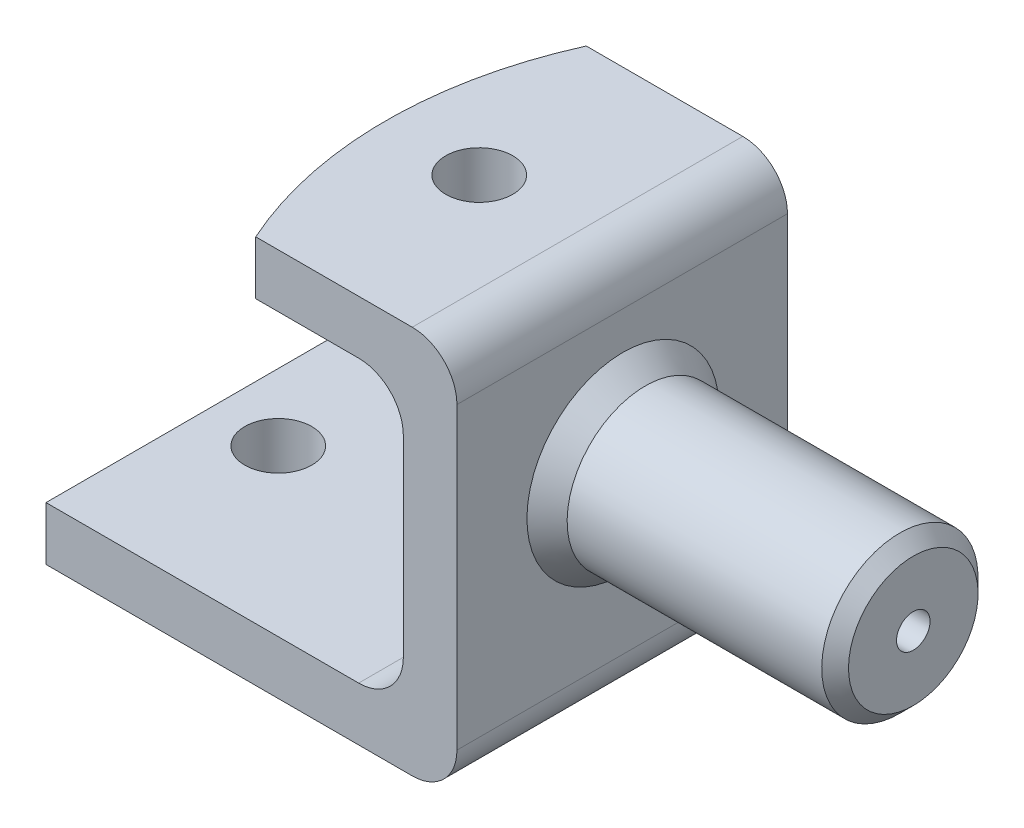
ISO-10303-21;
HEADER;
FILE_DESCRIPTION(('STEP AP214'),'2;1');
FILE_NAME('part.step','',(''),(''),'','','');
FILE_SCHEMA(('AUTOMOTIVE_DESIGN { 1 0 10303 214 1 1 1 1 }'));
ENDSEC;
DATA;
#1=APPLICATION_CONTEXT('core data for automotive mechanical design processes');
#2=APPLICATION_PROTOCOL_DEFINITION('international standard','automotive_design',2000,#1);
#3=PRODUCT_CONTEXT('',#1,'mechanical');
#4=PRODUCT('Part','Part','',(#3));
#5=PRODUCT_RELATED_PRODUCT_CATEGORY('part','',(#4));
#6=PRODUCT_DEFINITION_FORMATION('','',#4);
#7=PRODUCT_DEFINITION_CONTEXT('part definition',#1,'design');
#8=PRODUCT_DEFINITION('design','',#6,#7);
#9=PRODUCT_DEFINITION_SHAPE('','',#8);
#10=(LENGTH_UNIT() NAMED_UNIT(*) SI_UNIT(.MILLI.,.METRE.));
#11=(NAMED_UNIT(*) PLANE_ANGLE_UNIT() SI_UNIT($,.RADIAN.));
#12=(NAMED_UNIT(*) SI_UNIT($,.STERADIAN.) SOLID_ANGLE_UNIT());
#13=UNCERTAINTY_MEASURE_WITH_UNIT(LENGTH_MEASURE(1.E-05),#10,'distance_accuracy_value','');
#14=(GEOMETRIC_REPRESENTATION_CONTEXT(3) GLOBAL_UNCERTAINTY_ASSIGNED_CONTEXT((#13)) GLOBAL_UNIT_ASSIGNED_CONTEXT((#10,
#11,#12)) REPRESENTATION_CONTEXT('',''));
#15=CARTESIAN_POINT('',(0.,0.,0.));
#16=DIRECTION('',(0.,0.,1.));
#17=DIRECTION('',(1.,0.,0.));
#18=AXIS2_PLACEMENT_3D('',#15,#16,#17);
#19=CARTESIAN_POINT('',(68.6210379074638,91.8510314456974,27.3777811831614));
#20=DIRECTION('',(1.,0.,0.));
#21=DIRECTION('',(0.,0.,-1.));
#22=AXIS2_PLACEMENT_3D('',#19,#20,#21);
#23=PLANE('',#22);
#24=DIRECTION('',(0.,-1.,0.));
#25=VECTOR('',#24,1.);
#26=CARTESIAN_POINT('',(68.6210379074638,91.8510314456974,101.377781183161));
#27=LINE('',#26,#25);
#28=CARTESIAN_POINT('',(68.6210379074638,81.8510314456974,101.377781183161));
#29=VERTEX_POINT('',#28);
#30=CARTESIAN_POINT('',(68.6210379074638,38.8510314456974,101.377781183161));
#31=VERTEX_POINT('',#30);
#32=EDGE_CURVE('P0_E169',#29,#31,#27,.T.);
#33=ORIENTED_EDGE('',*,*,#32,.F.);
#34=DIRECTION('',(0.,0.,1.));
#35=VECTOR('',#34,1.);
#36=CARTESIAN_POINT('',(68.6210379074638,81.8510314456974,27.3777811831614));
#37=LINE('',#36,#35);
#38=CARTESIAN_POINT('',(68.6210379074638,81.8510314456974,27.3777811831614));
#39=VERTEX_POINT('',#38);
#40=EDGE_CURVE('P0_E196',#29,#39,#37,.F.);
#41=ORIENTED_EDGE('',*,*,#40,.T.);
#42=DIRECTION('',(0.,-1.,0.));
#43=VECTOR('',#42,1.);
#44=CARTESIAN_POINT('',(68.6210379074638,91.8510314456974,27.3777811831614));
#45=LINE('',#44,#43);
#46=CARTESIAN_POINT('',(68.6210379074638,38.8510314456974,27.3777811831614));
#47=VERTEX_POINT('',#46);
#48=EDGE_CURVE('P0_E168',#39,#47,#45,.T.);
#49=ORIENTED_EDGE('',*,*,#48,.T.);
#50=DIRECTION('',(0.,0.,-1.));
#51=VECTOR('',#50,1.);
#52=CARTESIAN_POINT('',(68.6210379074638,38.8510314456974,101.377781183161));
#53=LINE('',#52,#51);
#54=EDGE_CURVE('P0_E194',#47,#31,#53,.F.);
#55=ORIENTED_EDGE('',*,*,#54,.T.);
#56=EDGE_LOOP('',(#33,#41,#49,#55));
#57=FACE_BOUND('',#56,.T.);
#58=ADVANCED_FACE('P0_F37',(#57),#23,.F.);
#59=CARTESIAN_POINT('',(117.621037907464,16.8510314456974,64.3777811831614));
#60=DIRECTION('',(0.,1.,0.));
#61=DIRECTION('',(0.,0.,1.));
#62=AXIS2_PLACEMENT_3D('',#59,#60,#61);
#63=CYLINDRICAL_SURFACE('',#62,90.0000000000001);
#64=DIRECTION('',(0.,1.,0.));
#65=VECTOR('',#64,1.);
#66=CARTESIAN_POINT('',(35.578366083589,16.8510314456974,27.3777811831614));
#67=LINE('',#66,#65);
#68=CARTESIAN_POINT('',(35.578366083589,91.8510314456974,27.3777811831614));
#69=VERTEX_POINT('',#68);
#70=CARTESIAN_POINT('',(35.578366083589,103.851031445697,27.3777811831614));
#71=VERTEX_POINT('',#70);
#72=EDGE_CURVE('P0_E187',#69,#71,#67,.T.);
#73=ORIENTED_EDGE('',*,*,#72,.F.);
#74=CARTESIAN_POINT('',(117.621037907464,91.8510314456974,64.3777811831614));
#75=DIRECTION('',(0.,-1.,0.));
#76=DIRECTION('',(0.,0.,-1.));
#77=AXIS2_PLACEMENT_3D('',#74,#75,#76);
#78=CIRCLE('',#77,90.0000000000001);
#79=CARTESIAN_POINT('',(35.578366083589,91.8510314456974,101.377781183161));
#80=VERTEX_POINT('',#79);
#81=EDGE_CURVE('P0_E166',#80,#69,#78,.T.);
#82=ORIENTED_EDGE('',*,*,#81,.F.);
#83=DIRECTION('',(0.,1.,0.));
#84=VECTOR('',#83,1.);
#85=CARTESIAN_POINT('',(35.578366083589,16.8510314456974,101.377781183161));
#86=LINE('',#85,#84);
#87=CARTESIAN_POINT('',(35.578366083589,103.851031445697,101.377781183161));
#88=VERTEX_POINT('',#87);
#89=EDGE_CURVE('P0_E185',#80,#88,#86,.T.);
#90=ORIENTED_EDGE('',*,*,#89,.T.);
#91=CARTESIAN_POINT('',(117.621037907464,103.851031445697,64.3777811831614));
#92=DIRECTION('',(0.,1.,0.));
#93=DIRECTION('',(0.,0.,1.));
#94=AXIS2_PLACEMENT_3D('',#91,#92,#93);
#95=CIRCLE('',#94,90.0000000000001);
#96=EDGE_CURVE('P0_E178',#71,#88,#95,.T.);
#97=ORIENTED_EDGE('',*,*,#96,.F.);
#98=EDGE_LOOP('',(#73,#82,#90,#97));
#99=FACE_BOUND('',#98,.T.);
#100=ADVANCED_FACE('P0_F253',(#99),#63,.T.);
#101=CARTESIAN_POINT('',(80.6210379074638,16.8510314456974,101.377781183161));
#102=DIRECTION('',(1.,0.,0.));
#103=DIRECTION('',(0.,0.,-1.));
#104=AXIS2_PLACEMENT_3D('',#101,#102,#103);
#105=PLANE('',#104);
#106=DIRECTION('',(0.,1.,0.));
#107=VECTOR('',#106,1.);
#108=CARTESIAN_POINT('',(80.6210379074638,16.8510314456974,101.377781183161));
#109=LINE('',#108,#107);
#110=CARTESIAN_POINT('',(80.6210379074638,26.8510314456974,101.377781183161));
#111=VERTEX_POINT('',#110);
#112=CARTESIAN_POINT('',(80.6210379074638,93.8510314456974,101.377781183161));
#113=VERTEX_POINT('',#112);
#114=EDGE_CURVE('P0_E182',#111,#113,#109,.T.);
#115=ORIENTED_EDGE('',*,*,#114,.F.);
#116=DIRECTION('',(0.,0.,-1.));
#117=VECTOR('',#116,1.);
#118=CARTESIAN_POINT('',(80.6210379074638,26.8510314456974,27.3777811831614));
#119=LINE('',#118,#117);
#120=CARTESIAN_POINT('',(80.6210379074638,26.8510314456974,27.3777811831614));
#121=VERTEX_POINT('',#120);
#122=EDGE_CURVE('P0_E203',#111,#121,#119,.T.);
#123=ORIENTED_EDGE('',*,*,#122,.T.);
#124=DIRECTION('',(0.,1.,0.));
#125=VECTOR('',#124,1.);
#126=CARTESIAN_POINT('',(80.6210379074638,16.8510314456974,27.3777811831614));
#127=LINE('',#126,#125);
#128=CARTESIAN_POINT('',(80.6210379074638,93.8510314456974,27.3777811831614));
#129=VERTEX_POINT('',#128);
#130=EDGE_CURVE('P0_E132',#121,#129,#127,.T.);
#131=ORIENTED_EDGE('',*,*,#130,.T.);
#132=DIRECTION('',(0.,0.,-1.));
#133=VECTOR('',#132,1.);
#134=CARTESIAN_POINT('',(80.6210379074638,93.8510314456974,101.377781183161));
#135=LINE('',#134,#133);
#136=EDGE_CURVE('P0_E201',#129,#113,#135,.F.);
#137=ORIENTED_EDGE('',*,*,#136,.T.);
#138=EDGE_LOOP('',(#115,#123,#131,#137));
#139=FACE_BOUND('',#138,.T.);
#140=ADVANCED_FACE('P0_F241',(#139),#105,.T.);
#141=CARTESIAN_POINT('',(35.578366083589,16.8510314456974,101.377781183161));
#142=DIRECTION('',(0.,0.,1.));
#143=DIRECTION('',(1.,0.,0.));
#144=AXIS2_PLACEMENT_3D('',#141,#142,#143);
#145=PLANE('',#144);
#146=DIRECTION('',(1.,0.,0.));
#147=VECTOR('',#146,1.);
#148=CARTESIAN_POINT('',(35.578366083589,16.8510314456974,101.377781183161));
#149=LINE('',#148,#147);
#150=CARTESIAN_POINT('',(-11.3789620925362,16.8510314456974,101.377781183161));
#151=VERTEX_POINT('',#150);
#152=CARTESIAN_POINT('',(70.6210379074638,16.8510314456974,101.377781183161));
#153=VERTEX_POINT('',#152);
#154=EDGE_CURVE('P0_E126',#151,#153,#149,.T.);
#155=ORIENTED_EDGE('',*,*,#154,.T.);
#156=CARTESIAN_POINT('',(70.6210379074638,26.8510314456974,101.377781183161));
#157=DIRECTION('',(0.,0.,1.));
#158=DIRECTION('',(1.,0.,0.));
#159=AXIS2_PLACEMENT_3D('',#156,#157,#158);
#160=CIRCLE('',#159,10.);
#161=EDGE_CURVE('P0_E212',#153,#111,#160,.T.);
#162=ORIENTED_EDGE('',*,*,#161,.T.);
#163=ORIENTED_EDGE('',*,*,#114,.T.);
#164=CARTESIAN_POINT('',(70.6210379074638,93.8510314456974,101.377781183161));
#165=DIRECTION('',(0.,0.,1.));
#166=DIRECTION('',(1.,0.,0.));
#167=AXIS2_PLACEMENT_3D('',#164,#165,#166);
#168=CIRCLE('',#167,10.);
#169=CARTESIAN_POINT('',(70.6210379074638,103.851031445697,101.377781183161));
#170=VERTEX_POINT('',#169);
#171=EDGE_CURVE('P0_E52',#113,#170,#168,.T.);
#172=ORIENTED_EDGE('',*,*,#171,.T.);
#173=DIRECTION('',(1.,0.,0.));
#174=VECTOR('',#173,1.);
#175=CARTESIAN_POINT('',(35.578366083589,103.851031445697,101.377781183161));
#176=LINE('',#175,#174);
#177=EDGE_CURVE('P0_E175',#88,#170,#176,.T.);
#178=ORIENTED_EDGE('',*,*,#177,.F.);
#179=ORIENTED_EDGE('',*,*,#89,.F.);
#180=DIRECTION('',(-1.,0.,0.));
#181=VECTOR('',#180,1.);
#182=CARTESIAN_POINT('',(68.6210379074638,91.8510314456974,101.377781183161));
#183=LINE('',#182,#181);
#184=CARTESIAN_POINT('',(58.6210379074638,91.8510314456974,101.377781183161));
#185=VERTEX_POINT('',#184);
#186=EDGE_CURVE('P0_E164',#185,#80,#183,.T.);
#187=ORIENTED_EDGE('',*,*,#186,.F.);
#188=CARTESIAN_POINT('',(58.6210379074638,81.8510314456974,101.377781183161));
#189=DIRECTION('',(0.,0.,1.));
#190=DIRECTION('',(1.,0.,0.));
#191=AXIS2_PLACEMENT_3D('',#188,#189,#190);
#192=CIRCLE('',#191,10.);
#193=EDGE_CURVE('P0_E217',#185,#29,#192,.F.);
#194=ORIENTED_EDGE('',*,*,#193,.T.);
#195=ORIENTED_EDGE('',*,*,#32,.T.);
#196=CARTESIAN_POINT('',(58.6210379074638,38.8510314456974,101.377781183161));
#197=DIRECTION('',(0.,0.,1.));
#198=DIRECTION('',(1.,0.,0.));
#199=AXIS2_PLACEMENT_3D('',#196,#197,#198);
#200=CIRCLE('',#199,10.);
#201=CARTESIAN_POINT('',(58.6210379074638,28.8510314456974,101.377781183161));
#202=VERTEX_POINT('',#201);
#203=EDGE_CURVE('P0_E11',#31,#202,#200,.F.);
#204=ORIENTED_EDGE('',*,*,#203,.T.);
#205=DIRECTION('',(1.,0.,0.));
#206=VECTOR('',#205,1.);
#207=CARTESIAN_POINT('',(-11.3789620925362,28.8510314456974,101.377781183161));
#208=LINE('',#207,#206);
#209=CARTESIAN_POINT('',(-11.3789620925362,28.8510314456974,101.377781183161));
#210=VERTEX_POINT('',#209);
#211=EDGE_CURVE('P0_E139',#210,#202,#208,.T.);
#212=ORIENTED_EDGE('',*,*,#211,.F.);
#213=DIRECTION('',(0.,1.,0.));
#214=VECTOR('',#213,1.);
#215=CARTESIAN_POINT('',(-11.3789620925362,28.8510314456974,101.377781183161));
#216=LINE('',#215,#214);
#217=EDGE_CURVE('P0_E136',#151,#210,#216,.T.);
#218=ORIENTED_EDGE('',*,*,#217,.F.);
#219=EDGE_LOOP('',(#155,#162,#163,#172,#178,#179,#187,#194,#195,#204,#212,#218));
#220=FACE_BOUND('',#219,.T.);
#221=ADVANCED_FACE('P0_F137',(#220),#145,.T.);
#222=CARTESIAN_POINT('',(80.6210379074638,16.8510314456974,27.3777811831614));
#223=DIRECTION('',(0.,0.,-1.));
#224=DIRECTION('',(-1.,0.,0.));
#225=AXIS2_PLACEMENT_3D('',#222,#223,#224);
#226=PLANE('',#225);
#227=ORIENTED_EDGE('',*,*,#130,.F.);
#228=CARTESIAN_POINT('',(70.6210379074638,26.8510314456974,27.3777811831614));
#229=DIRECTION('',(0.,0.,-1.));
#230=DIRECTION('',(-1.,0.,0.));
#231=AXIS2_PLACEMENT_3D('',#228,#229,#230);
#232=CIRCLE('',#231,10.);
#233=CARTESIAN_POINT('',(70.6210379074638,16.8510314456974,27.3777811831614));
#234=VERTEX_POINT('',#233);
#235=EDGE_CURVE('P0_E208',#121,#234,#232,.T.);
#236=ORIENTED_EDGE('',*,*,#235,.T.);
#237=DIRECTION('',(-1.,0.,0.));
#238=VECTOR('',#237,1.);
#239=CARTESIAN_POINT('',(80.6210379074638,16.8510314456974,27.3777811831614));
#240=LINE('',#239,#238);
#241=CARTESIAN_POINT('',(-11.3789620925362,16.8510314456974,27.3777811831614));
#242=VERTEX_POINT('',#241);
#243=EDGE_CURVE('P0_E133',#234,#242,#240,.T.);
#244=ORIENTED_EDGE('',*,*,#243,.T.);
#245=DIRECTION('',(0.,-1.,0.));
#246=VECTOR('',#245,1.);
#247=CARTESIAN_POINT('',(-11.3789620925362,16.8510314456974,27.3777811831614));
#248=LINE('',#247,#246);
#249=CARTESIAN_POINT('',(-11.3789620925362,28.8510314456974,27.3777811831614));
#250=VERTEX_POINT('',#249);
#251=EDGE_CURVE('P0_E147',#250,#242,#248,.T.);
#252=ORIENTED_EDGE('',*,*,#251,.F.);
#253=DIRECTION('',(1.,0.,0.));
#254=VECTOR('',#253,1.);
#255=CARTESIAN_POINT('',(-11.3789620925362,28.8510314456974,27.3777811831614));
#256=LINE('',#255,#254);
#257=CARTESIAN_POINT('',(58.6210379074638,28.8510314456974,27.3777811831614));
#258=VERTEX_POINT('',#257);
#259=EDGE_CURVE('P0_E157',#250,#258,#256,.T.);
#260=ORIENTED_EDGE('',*,*,#259,.T.);
#261=CARTESIAN_POINT('',(58.6210379074638,38.8510314456974,27.3777811831614));
#262=DIRECTION('',(0.,0.,-1.));
#263=DIRECTION('',(-1.,0.,0.));
#264=AXIS2_PLACEMENT_3D('',#261,#262,#263);
#265=CIRCLE('',#264,10.);
#266=EDGE_CURVE('P0_E45',#258,#47,#265,.F.);
#267=ORIENTED_EDGE('',*,*,#266,.T.);
#268=ORIENTED_EDGE('',*,*,#48,.F.);
#269=CARTESIAN_POINT('',(58.6210379074638,81.8510314456974,27.3777811831614));
#270=DIRECTION('',(0.,0.,-1.));
#271=DIRECTION('',(-1.,0.,0.));
#272=AXIS2_PLACEMENT_3D('',#269,#270,#271);
#273=CIRCLE('',#272,10.);
#274=CARTESIAN_POINT('',(58.6210379074638,91.8510314456974,27.3777811831614));
#275=VERTEX_POINT('',#274);
#276=EDGE_CURVE('P0_E219',#39,#275,#273,.F.);
#277=ORIENTED_EDGE('',*,*,#276,.T.);
#278=DIRECTION('',(1.,0.,0.));
#279=VECTOR('',#278,1.);
#280=CARTESIAN_POINT('',(35.578366083589,91.8510314456974,27.3777811831614));
#281=LINE('',#280,#279);
#282=EDGE_CURVE('P0_E161',#69,#275,#281,.T.);
#283=ORIENTED_EDGE('',*,*,#282,.F.);
#284=ORIENTED_EDGE('',*,*,#72,.T.);
#285=DIRECTION('',(-1.,0.,0.));
#286=VECTOR('',#285,1.);
#287=CARTESIAN_POINT('',(80.6210379074638,103.851031445697,27.3777811831614));
#288=LINE('',#287,#286);
#289=CARTESIAN_POINT('',(70.6210379074638,103.851031445697,27.3777811831614));
#290=VERTEX_POINT('',#289);
#291=EDGE_CURVE('P0_E172',#290,#71,#288,.T.);
#292=ORIENTED_EDGE('',*,*,#291,.F.);
#293=CARTESIAN_POINT('',(70.6210379074638,93.8510314456974,27.3777811831614));
#294=DIRECTION('',(0.,0.,-1.));
#295=DIRECTION('',(-1.,0.,0.));
#296=AXIS2_PLACEMENT_3D('',#293,#294,#295);
#297=CIRCLE('',#296,10.);
#298=EDGE_CURVE('P0_E206',#290,#129,#297,.T.);
#299=ORIENTED_EDGE('',*,*,#298,.T.);
#300=EDGE_LOOP('',(#227,#236,#244,#252,#260,#267,#268,#277,#283,#284,#292,#299));
#301=FACE_BOUND('',#300,.T.);
#302=ADVANCED_FACE('P0_F223',(#301),#226,.T.);
#303=CARTESIAN_POINT('',(117.621037907464,16.8510314456974,64.3777811831614));
#304=DIRECTION('',(0.,1.,0.));
#305=DIRECTION('',(0.,0.,1.));
#306=AXIS2_PLACEMENT_3D('',#303,#304,#305);
#307=PLANE('',#306);
#308=CARTESIAN_POINT('',(3.62103790746377,16.8510314456974,64.3777811831614));
#309=DIRECTION('',(0.,-1.,0.));
#310=DIRECTION('',(0.,0.,-1.));
#311=AXIS2_PLACEMENT_3D('',#308,#309,#310);
#312=CIRCLE('',#311,7.49999999999998);
#313=CARTESIAN_POINT('',(3.62103790746377,16.8510314456974,56.8777811831614));
#314=VERTEX_POINT('',#313);
#315=EDGE_CURVE('P0_E410',#314,#314,#312,.T.);
#316=ORIENTED_EDGE('',*,*,#315,.F.);
#317=EDGE_LOOP('',(#316));
#318=FACE_BOUND('',#317,.T.);
#319=ORIENTED_EDGE('',*,*,#243,.F.);
#320=DIRECTION('',(0.,0.,-1.));
#321=VECTOR('',#320,1.);
#322=CARTESIAN_POINT('',(70.6210379074638,16.8510314456974,101.377781183161));
#323=LINE('',#322,#321);
#324=EDGE_CURVE('P0_E60',#234,#153,#323,.F.);
#325=ORIENTED_EDGE('',*,*,#324,.T.);
#326=ORIENTED_EDGE('',*,*,#154,.F.);
#327=DIRECTION('',(0.,0.,1.));
#328=VECTOR('',#327,1.);
#329=CARTESIAN_POINT('',(-11.3789620925362,16.8510314456974,101.377781183161));
#330=LINE('',#329,#328);
#331=EDGE_CURVE('P0_E130',#242,#151,#330,.T.);
#332=ORIENTED_EDGE('',*,*,#331,.F.);
#333=EDGE_LOOP('',(#319,#325,#326,#332));
#334=FACE_BOUND('',#333,.T.);
#335=ADVANCED_FACE('P0_F128',(#318,#334),#307,.F.);
#336=CARTESIAN_POINT('',(117.621037907464,103.851031445697,64.3777811831614));
#337=DIRECTION('',(0.,1.,0.));
#338=DIRECTION('',(0.,0.,1.));
#339=AXIS2_PLACEMENT_3D('',#336,#337,#338);
#340=PLANE('',#339);
#341=CARTESIAN_POINT('',(48.6210379074638,103.851031445697,64.3777811831614));
#342=DIRECTION('',(0.,-1.,0.));
#343=DIRECTION('',(0.,0.,-1.));
#344=AXIS2_PLACEMENT_3D('',#341,#342,#343);
#345=CIRCLE('',#344,7.49999999999999);
#346=CARTESIAN_POINT('',(48.6210379074638,103.851031445697,56.8777811831614));
#347=VERTEX_POINT('',#346);
#348=EDGE_CURVE('P0_E148',#347,#347,#345,.T.);
#349=ORIENTED_EDGE('',*,*,#348,.T.);
#350=EDGE_LOOP('',(#349));
#351=FACE_BOUND('',#350,.T.);
#352=ORIENTED_EDGE('',*,*,#177,.T.);
#353=DIRECTION('',(0.,0.,-1.));
#354=VECTOR('',#353,1.);
#355=CARTESIAN_POINT('',(70.6210379074638,103.851031445697,64.3777811831614));
#356=LINE('',#355,#354);
#357=EDGE_CURVE('P0_E214',#170,#290,#356,.T.);
#358=ORIENTED_EDGE('',*,*,#357,.T.);
#359=ORIENTED_EDGE('',*,*,#291,.T.);
#360=ORIENTED_EDGE('',*,*,#96,.T.);
#361=EDGE_LOOP('',(#352,#358,#359,#360));
#362=FACE_BOUND('',#361,.T.);
#363=ADVANCED_FACE('P0_F247',(#351,#362),#340,.T.);
#364=CARTESIAN_POINT('',(117.621037907464,91.8510314456974,64.3777811831614));
#365=DIRECTION('',(0.,-1.,0.));
#366=DIRECTION('',(0.,0.,-1.));
#367=AXIS2_PLACEMENT_3D('',#364,#365,#366);
#368=PLANE('',#367);
#369=CARTESIAN_POINT('',(48.6210379074638,91.8510314456974,64.3777811831614));
#370=DIRECTION('',(0.,-1.,0.));
#371=DIRECTION('',(0.,0.,-1.));
#372=AXIS2_PLACEMENT_3D('',#369,#370,#371);
#373=CIRCLE('',#372,7.49999999999999);
#374=CARTESIAN_POINT('',(48.6210379074638,91.8510314456974,56.8777811831614));
#375=VERTEX_POINT('',#374);
#376=EDGE_CURVE('P0_E151',#375,#375,#373,.T.);
#377=ORIENTED_EDGE('',*,*,#376,.F.);
#378=EDGE_LOOP('',(#377));
#379=FACE_BOUND('',#378,.T.);
#380=ORIENTED_EDGE('',*,*,#282,.T.);
#381=DIRECTION('',(0.,0.,1.));
#382=VECTOR('',#381,1.);
#383=CARTESIAN_POINT('',(58.6210379074638,91.8510314456974,64.3777811831614));
#384=LINE('',#383,#382);
#385=EDGE_CURVE('P0_E184',#275,#185,#384,.T.);
#386=ORIENTED_EDGE('',*,*,#385,.T.);
#387=ORIENTED_EDGE('',*,*,#186,.T.);
#388=ORIENTED_EDGE('',*,*,#81,.T.);
#389=EDGE_LOOP('',(#380,#386,#387,#388));
#390=FACE_BOUND('',#389,.T.);
#391=ADVANCED_FACE('P0_F257',(#379,#390),#368,.T.);
#392=CARTESIAN_POINT('',(-11.3789620925362,28.8510314456974,27.3777811831614));
#393=DIRECTION('',(0.,-1.,0.));
#394=DIRECTION('',(0.,0.,-1.));
#395=AXIS2_PLACEMENT_3D('',#392,#393,#394);
#396=PLANE('',#395);
#397=CARTESIAN_POINT('',(3.62103790746377,28.8510314456974,64.3777811831614));
#398=DIRECTION('',(0.,-1.,0.));
#399=DIRECTION('',(0.,0.,-1.));
#400=AXIS2_PLACEMENT_3D('',#397,#398,#399);
#401=CIRCLE('',#400,7.49999999999998);
#402=CARTESIAN_POINT('',(3.62103790746377,28.8510314456974,56.8777811831614));
#403=VERTEX_POINT('',#402);
#404=EDGE_CURVE('P0_E408',#403,#403,#401,.T.);
#405=ORIENTED_EDGE('',*,*,#404,.T.);
#406=EDGE_LOOP('',(#405));
#407=FACE_BOUND('',#406,.T.);
#408=ORIENTED_EDGE('',*,*,#211,.T.);
#409=DIRECTION('',(0.,0.,-1.));
#410=VECTOR('',#409,1.);
#411=CARTESIAN_POINT('',(58.6210379074638,28.8510314456974,27.3777811831614));
#412=LINE('',#411,#410);
#413=EDGE_CURVE('P0_E198',#202,#258,#412,.T.);
#414=ORIENTED_EDGE('',*,*,#413,.T.);
#415=ORIENTED_EDGE('',*,*,#259,.F.);
#416=DIRECTION('',(0.,0.,-1.));
#417=VECTOR('',#416,1.);
#418=CARTESIAN_POINT('',(-11.3789620925362,28.8510314456974,27.3777811831614));
#419=LINE('',#418,#417);
#420=EDGE_CURVE('P0_E142',#210,#250,#419,.T.);
#421=ORIENTED_EDGE('',*,*,#420,.F.);
#422=EDGE_LOOP('',(#408,#414,#415,#421));
#423=FACE_BOUND('',#422,.T.);
#424=ADVANCED_FACE('P0_F235',(#407,#423),#396,.F.);
#425=CARTESIAN_POINT('',(-11.3789620925362,0.,0.));
#426=DIRECTION('',(1.,0.,0.));
#427=DIRECTION('',(0.,0.,-1.));
#428=AXIS2_PLACEMENT_3D('',#425,#426,#427);
#429=PLANE('',#428);
#430=ORIENTED_EDGE('',*,*,#331,.T.);
#431=ORIENTED_EDGE('',*,*,#217,.T.);
#432=ORIENTED_EDGE('',*,*,#420,.T.);
#433=ORIENTED_EDGE('',*,*,#251,.T.);
#434=EDGE_LOOP('',(#430,#431,#432,#433));
#435=FACE_BOUND('',#434,.T.);
#436=ADVANCED_FACE('P0_F145',(#435),#429,.F.);
#437=CARTESIAN_POINT('',(48.6210379074638,91.8510314456974,64.3777811831614));
#438=DIRECTION('',(0.,-1.,0.));
#439=DIRECTION('',(0.,0.,-1.));
#440=AXIS2_PLACEMENT_3D('',#437,#438,#439);
#441=CYLINDRICAL_SURFACE('',#440,7.49999999999999);
#442=ORIENTED_EDGE('',*,*,#348,.F.);
#443=EDGE_LOOP('',(#442));
#444=FACE_BOUND('',#443,.T.);
#445=ORIENTED_EDGE('',*,*,#376,.T.);
#446=EDGE_LOOP('',(#445));
#447=FACE_BOUND('',#446,.T.);
#448=ADVANCED_FACE('P0_F269',(#444,#447),#441,.F.);
#449=CARTESIAN_POINT('',(3.62103790746377,16.8510314456974,64.3777811831614));
#450=DIRECTION('',(0.,-1.,0.));
#451=DIRECTION('',(0.,0.,-1.));
#452=AXIS2_PLACEMENT_3D('',#449,#450,#451);
#453=CYLINDRICAL_SURFACE('',#452,7.49999999999998);
#454=ORIENTED_EDGE('',*,*,#315,.T.);
#455=EDGE_LOOP('',(#454));
#456=FACE_BOUND('',#455,.T.);
#457=ORIENTED_EDGE('',*,*,#404,.F.);
#458=EDGE_LOOP('',(#457));
#459=FACE_BOUND('',#458,.T.);
#460=ADVANCED_FACE('P0_F262',(#456,#459),#453,.F.);
#461=CARTESIAN_POINT('',(58.6210379074638,81.8510314456974,64.3777811831614));
#462=DIRECTION('',(0.,0.,1.));
#463=DIRECTION('',(1.,0.,0.));
#464=AXIS2_PLACEMENT_3D('',#461,#462,#463);
#465=CYLINDRICAL_SURFACE('',#464,10.);
#466=ORIENTED_EDGE('',*,*,#276,.F.);
#467=ORIENTED_EDGE('',*,*,#40,.F.);
#468=ORIENTED_EDGE('',*,*,#193,.F.);
#469=ORIENTED_EDGE('',*,*,#385,.F.);
#470=EDGE_LOOP('',(#466,#467,#468,#469));
#471=FACE_BOUND('',#470,.T.);
#472=ADVANCED_FACE('P0_F260',(#471),#465,.F.);
#473=CARTESIAN_POINT('',(58.6210379074638,38.8510314456974,27.3777811831614));
#474=DIRECTION('',(0.,0.,1.));
#475=DIRECTION('',(1.,0.,0.));
#476=AXIS2_PLACEMENT_3D('',#473,#474,#475);
#477=CYLINDRICAL_SURFACE('',#476,10.);
#478=ORIENTED_EDGE('',*,*,#203,.F.);
#479=ORIENTED_EDGE('',*,*,#54,.F.);
#480=ORIENTED_EDGE('',*,*,#266,.F.);
#481=ORIENTED_EDGE('',*,*,#413,.F.);
#482=EDGE_LOOP('',(#478,#479,#480,#481));
#483=FACE_BOUND('',#482,.T.);
#484=ADVANCED_FACE('P0_F233',(#483),#477,.F.);
#485=CARTESIAN_POINT('',(70.6210379074638,26.8510314456974,101.377781183161));
#486=DIRECTION('',(0.,0.,1.));
#487=DIRECTION('',(1.,0.,0.));
#488=AXIS2_PLACEMENT_3D('',#485,#486,#487);
#489=CYLINDRICAL_SURFACE('',#488,10.);
#490=ORIENTED_EDGE('',*,*,#161,.F.);
#491=ORIENTED_EDGE('',*,*,#324,.F.);
#492=ORIENTED_EDGE('',*,*,#235,.F.);
#493=ORIENTED_EDGE('',*,*,#122,.F.);
#494=EDGE_LOOP('',(#490,#491,#492,#493));
#495=FACE_BOUND('',#494,.T.);
#496=ADVANCED_FACE('P0_F237',(#495),#489,.T.);
#497=CARTESIAN_POINT('',(70.6210379074638,93.8510314456974,64.3777811831614));
#498=DIRECTION('',(0.,0.,-1.));
#499=DIRECTION('',(-1.,0.,0.));
#500=AXIS2_PLACEMENT_3D('',#497,#498,#499);
#501=CYLINDRICAL_SURFACE('',#500,10.);
#502=ORIENTED_EDGE('',*,*,#171,.F.);
#503=ORIENTED_EDGE('',*,*,#136,.F.);
#504=ORIENTED_EDGE('',*,*,#298,.F.);
#505=ORIENTED_EDGE('',*,*,#357,.F.);
#506=EDGE_LOOP('',(#502,#503,#504,#505));
#507=FACE_BOUND('',#506,.T.);
#508=ADVANCED_FACE('P0_F39',(#507),#501,.T.);
#509=CLOSED_SHELL('',(#58,#100,#140,#221,#302,#335,#363,#391,#424,#436,#448,#460,#472,#484,#496,#508));
#510=MANIFOLD_SOLID_BREP('P0_B2',#509);
#511=CARTESIAN_POINT('',(145.621037907464,78.2458603195792,62.1664644722832));
#512=DIRECTION('',(-1.,0.,0.));
#513=DIRECTION('',(0.,0.140625610645859,0.990062845293408));
#514=AXIS2_PLACEMENT_3D('',#511,#512,#513);
#515=PLANE('',#514);
#516=CARTESIAN_POINT('',(145.621037907464,63.8899490628248,64.2055358266482));
#517=DIRECTION('',(1.,0.,0.));
#518=DIRECTION('',(0.,-0.140625610645859,-0.990062845293408));
#519=AXIS2_PLACEMENT_3D('',#516,#517,#518);
#520=CIRCLE('',#519,3.75);
#521=CARTESIAN_POINT('',(145.621037907464,63.3626030229028,60.4928001567979));
#522=VERTEX_POINT('',#521);
#523=EDGE_CURVE('P1_E47',#522,#522,#520,.T.);
#524=ORIENTED_EDGE('',*,*,#523,.F.);
#525=EDGE_LOOP('',(#524));
#526=FACE_BOUND('',#525,.T.);
#527=CARTESIAN_POINT('',(145.621037907464,63.8899490628248,64.2055358266482));
#528=DIRECTION('',(-1.,0.,0.));
#529=DIRECTION('',(0.,0.140625610645859,0.990062845293408));
#530=AXIS2_PLACEMENT_3D('',#527,#528,#529);
#531=CIRCLE('',#530,14.5);
#532=CARTESIAN_POINT('',(145.621037907464,65.9290204171897,78.5614470834026));
#533=VERTEX_POINT('',#532);
#534=EDGE_CURVE('P1_E11',#533,#533,#531,.T.);
#535=ORIENTED_EDGE('',*,*,#534,.F.);
#536=EDGE_LOOP('',(#535));
#537=FACE_BOUND('',#536,.T.);
#538=ADVANCED_FACE('P1_F18',(#526,#537),#515,.F.);
#539=CARTESIAN_POINT('',(145.621037907464,63.8899490628248,64.2055358266482));
#540=DIRECTION('',(-1.,0.,0.));
#541=DIRECTION('',(0.,0.140625610645859,0.990062845293408));
#542=AXIS2_PLACEMENT_3D('',#539,#540,#541);
#543=CONICAL_SURFACE('',#542,14.5,0.785398163397447);
#544=CARTESIAN_POINT('',(142.621037907464,63.8899490628248,64.2055358266482));
#545=DIRECTION('',(-1.,0.,0.));
#546=DIRECTION('',(0.,0.140625610645859,0.990062845293408));
#547=AXIS2_PLACEMENT_3D('',#544,#545,#546);
#548=CIRCLE('',#547,17.5);
#549=CARTESIAN_POINT('',(142.621037907464,66.3508972491273,81.5316356192829));
#550=VERTEX_POINT('',#549);
#551=EDGE_CURVE('P1_E25',#550,#550,#548,.T.);
#552=ORIENTED_EDGE('',*,*,#551,.F.);
#553=EDGE_LOOP('',(#552));
#554=FACE_BOUND('',#553,.T.);
#555=ORIENTED_EDGE('',*,*,#534,.T.);
#556=EDGE_LOOP('',(#555));
#557=FACE_BOUND('',#556,.T.);
#558=ADVANCED_FACE('P1_F72',(#554,#557),#543,.T.);
#559=CARTESIAN_POINT('',(70.6527633842861,63.8899490628248,64.2055358266482));
#560=DIRECTION('',(-1.,0.,0.));
#561=DIRECTION('',(0.,0.140625610645859,0.990062845293408));
#562=AXIS2_PLACEMENT_3D('',#559,#560,#561);
#563=CYLINDRICAL_SURFACE('',#562,17.5);
#564=CARTESIAN_POINT('',(85.6210379074638,63.8899490628248,64.2055358266482));
#565=DIRECTION('',(-1.,0.,0.));
#566=DIRECTION('',(0.,0.140625610645859,0.990062845293408));
#567=AXIS2_PLACEMENT_3D('',#564,#565,#566);
#568=CIRCLE('',#567,17.5);
#569=CARTESIAN_POINT('',(85.6210379074638,66.3508972491273,81.5316356192828));
#570=VERTEX_POINT('',#569);
#571=EDGE_CURVE('P1_E31',#570,#570,#568,.T.);
#572=ORIENTED_EDGE('',*,*,#571,.F.);
#573=EDGE_LOOP('',(#572));
#574=FACE_BOUND('',#573,.T.);
#575=ORIENTED_EDGE('',*,*,#551,.T.);
#576=EDGE_LOOP('',(#575));
#577=FACE_BOUND('',#576,.T.);
#578=ADVANCED_FACE('P1_F67',(#574,#577),#563,.T.);
#579=CARTESIAN_POINT('',(85.6210379074638,63.8899490628248,64.2055358266482));
#580=DIRECTION('',(-1.,0.,0.));
#581=DIRECTION('',(0.,0.140625610645859,0.990062845293408));
#582=AXIS2_PLACEMENT_3D('',#579,#580,#581);
#583=CONICAL_SURFACE('',#582,17.5,0.674740942223553);
#584=CARTESIAN_POINT('',(80.6210379074638,63.8899490628248,64.2055358266482));
#585=DIRECTION('',(-1.,0.,0.));
#586=DIRECTION('',(0.,0.140625610645859,0.990062845293408));
#587=AXIS2_PLACEMENT_3D('',#584,#585,#586);
#588=CIRCLE('',#587,21.5);
#589=CARTESIAN_POINT('',(80.6210379074638,66.9133996917107,85.4918870004565));
#590=VERTEX_POINT('',#589);
#591=EDGE_CURVE('P1_E36',#590,#590,#588,.T.);
#592=ORIENTED_EDGE('',*,*,#591,.F.);
#593=EDGE_LOOP('',(#592));
#594=FACE_BOUND('',#593,.T.);
#595=ORIENTED_EDGE('',*,*,#571,.T.);
#596=EDGE_LOOP('',(#595));
#597=FACE_BOUND('',#596,.T.);
#598=ADVANCED_FACE('P1_F64',(#594,#597),#583,.T.);
#599=CARTESIAN_POINT('',(80.6210379074638,85.176300236633,61.1820851977622));
#600=DIRECTION('',(1.,0.,0.));
#601=DIRECTION('',(0.,-0.140625610645859,-0.990062845293408));
#602=AXIS2_PLACEMENT_3D('',#599,#600,#601);
#603=PLANE('',#602);
#604=CARTESIAN_POINT('',(80.6210379074638,63.8899490628248,64.2055358266482));
#605=DIRECTION('',(1.,0.,0.));
#606=DIRECTION('',(0.,-0.140625610645859,-0.990062845293408));
#607=AXIS2_PLACEMENT_3D('',#604,#605,#606);
#608=CIRCLE('',#607,3.75);
#609=CARTESIAN_POINT('',(80.6210379074638,63.3626030229028,60.4928001567979));
#610=VERTEX_POINT('',#609);
#611=EDGE_CURVE('P1_E52',#610,#610,#608,.T.);
#612=ORIENTED_EDGE('',*,*,#611,.T.);
#613=EDGE_LOOP('',(#612));
#614=FACE_BOUND('',#613,.T.);
#615=ORIENTED_EDGE('',*,*,#591,.T.);
#616=EDGE_LOOP('',(#615));
#617=FACE_BOUND('',#616,.T.);
#618=ADVANCED_FACE('P1_F62',(#614,#617),#603,.F.);
#619=CARTESIAN_POINT('',(80.6210379074638,63.8899490628248,64.2055358266482));
#620=DIRECTION('',(1.,0.,0.));
#621=DIRECTION('',(0.,-0.140625610645859,-0.990062845293408));
#622=AXIS2_PLACEMENT_3D('',#619,#620,#621);
#623=CYLINDRICAL_SURFACE('',#622,3.75);
#624=ORIENTED_EDGE('',*,*,#611,.F.);
#625=EDGE_LOOP('',(#624));
#626=FACE_BOUND('',#625,.T.);
#627=ORIENTED_EDGE('',*,*,#523,.T.);
#628=EDGE_LOOP('',(#627));
#629=FACE_BOUND('',#628,.T.);
#630=ADVANCED_FACE('P1_F84',(#626,#629),#623,.F.);
#631=CLOSED_SHELL('',(#538,#558,#578,#598,#618,#630));
#632=MANIFOLD_SOLID_BREP('P1_B1',#631);
#633=ADVANCED_BREP_SHAPE_REPRESENTATION('',(#18,#510,#632),#14);
#634=SHAPE_DEFINITION_REPRESENTATION(#9,#633);
ENDSEC;
END-ISO-10303-21;
